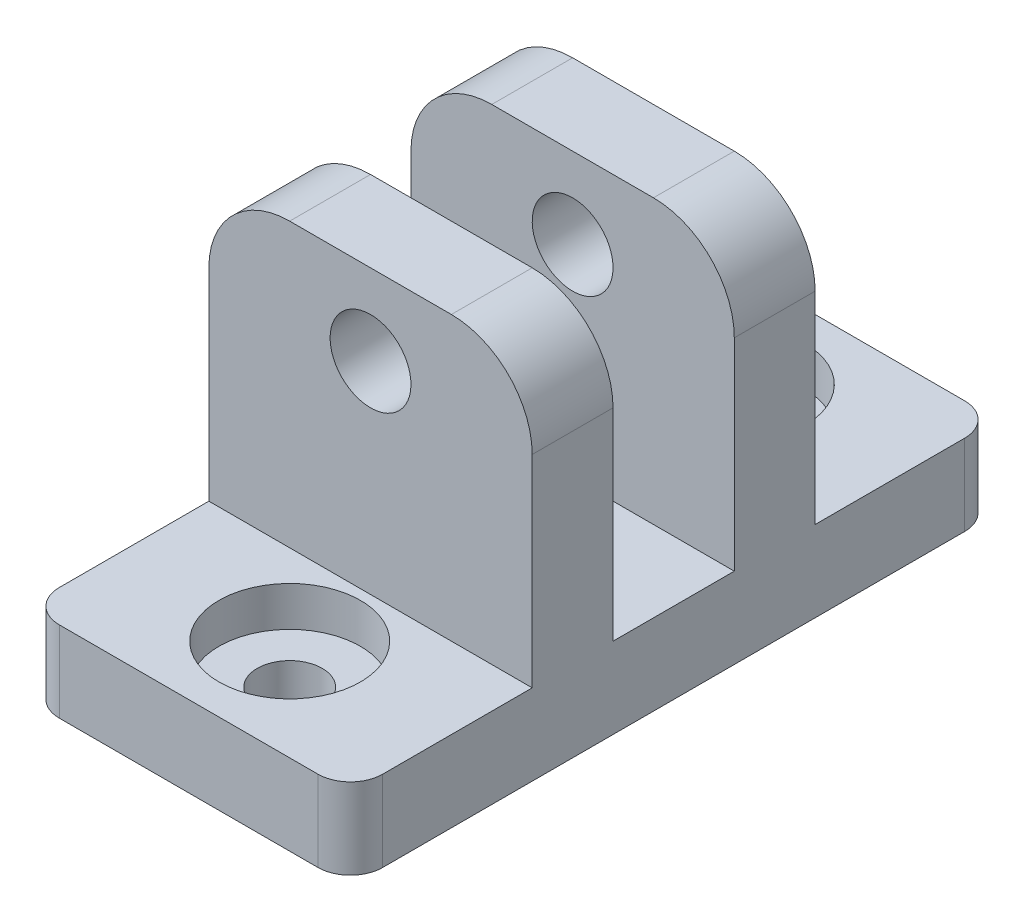
ISO-10303-21;
HEADER;
FILE_DESCRIPTION(('STEP AP214'),'2;1');
FILE_NAME('part.step','',(''),(''),'','','');
FILE_SCHEMA(('AUTOMOTIVE_DESIGN { 1 0 10303 214 1 1 1 1 }'));
ENDSEC;
DATA;
#1=APPLICATION_CONTEXT('core data for automotive mechanical design processes');
#2=APPLICATION_PROTOCOL_DEFINITION('international standard','automotive_design',2000,#1);
#3=PRODUCT_CONTEXT('',#1,'mechanical');
#4=PRODUCT('Part','Part','',(#3));
#5=PRODUCT_RELATED_PRODUCT_CATEGORY('part','',(#4));
#6=PRODUCT_DEFINITION_FORMATION('','',#4);
#7=PRODUCT_DEFINITION_CONTEXT('part definition',#1,'design');
#8=PRODUCT_DEFINITION('design','',#6,#7);
#9=PRODUCT_DEFINITION_SHAPE('','',#8);
#10=(LENGTH_UNIT() NAMED_UNIT(*) SI_UNIT(.MILLI.,.METRE.));
#11=(NAMED_UNIT(*) PLANE_ANGLE_UNIT() SI_UNIT($,.RADIAN.));
#12=(NAMED_UNIT(*) SI_UNIT($,.STERADIAN.) SOLID_ANGLE_UNIT());
#13=UNCERTAINTY_MEASURE_WITH_UNIT(LENGTH_MEASURE(1.E-05),#10,'distance_accuracy_value','');
#14=(GEOMETRIC_REPRESENTATION_CONTEXT(3) GLOBAL_UNCERTAINTY_ASSIGNED_CONTEXT((#13)) GLOBAL_UNIT_ASSIGNED_CONTEXT((#10,
#11,#12)) REPRESENTATION_CONTEXT('',''));
#15=CARTESIAN_POINT('',(0.,0.,0.));
#16=DIRECTION('',(0.,0.,1.));
#17=DIRECTION('',(1.,0.,0.));
#18=AXIS2_PLACEMENT_3D('',#15,#16,#17);
#19=CARTESIAN_POINT('',(0.,28.575,0.));
#20=DIRECTION('',(0.,-1.,0.));
#21=DIRECTION('',(0.,0.,-1.));
#22=AXIS2_PLACEMENT_3D('',#19,#20,#21);
#23=PLANE('',#22);
#24=DIRECTION('',(1.,0.,0.));
#25=VECTOR('',#24,1.);
#26=CARTESIAN_POINT('',(-12.7,28.575,11.1125));
#27=LINE('',#26,#25);
#28=CARTESIAN_POINT('',(-6.35,28.575,11.1125));
#29=VERTEX_POINT('',#28);
#30=CARTESIAN_POINT('',(6.35,28.575,11.1125));
#31=VERTEX_POINT('',#30);
#32=EDGE_CURVE('E314',#29,#31,#27,.T.);
#33=ORIENTED_EDGE('',*,*,#32,.T.);
#34=DIRECTION('',(0.,0.,-1.));
#35=VECTOR('',#34,1.);
#36=CARTESIAN_POINT('',(6.35,28.575,0.));
#37=LINE('',#36,#35);
#38=CARTESIAN_POINT('',(6.35,28.575,4.7625));
#39=VERTEX_POINT('',#38);
#40=EDGE_CURVE('E344',#31,#39,#37,.T.);
#41=ORIENTED_EDGE('',*,*,#40,.T.);
#42=DIRECTION('',(1.,0.,0.));
#43=VECTOR('',#42,1.);
#44=CARTESIAN_POINT('',(-12.7,28.575,4.7625));
#45=LINE('',#44,#43);
#46=CARTESIAN_POINT('',(-6.35,28.575,4.7625));
#47=VERTEX_POINT('',#46);
#48=EDGE_CURVE('E258',#47,#39,#45,.T.);
#49=ORIENTED_EDGE('',*,*,#48,.F.);
#50=DIRECTION('',(0.,0.,1.));
#51=VECTOR('',#50,1.);
#52=CARTESIAN_POINT('',(-6.35,28.575,0.));
#53=LINE('',#52,#51);
#54=EDGE_CURVE('E340',#47,#29,#53,.T.);
#55=ORIENTED_EDGE('',*,*,#54,.T.);
#56=EDGE_LOOP('',(#33,#41,#49,#55));
#57=FACE_BOUND('',#56,.T.);
#58=ADVANCED_FACE('F44',(#57),#23,.F.);
#59=CARTESIAN_POINT('',(12.7,28.575,25.4));
#60=DIRECTION('',(-1.,0.,0.));
#61=DIRECTION('',(0.,0.,1.));
#62=AXIS2_PLACEMENT_3D('',#59,#60,#61);
#63=PLANE('',#62);
#64=DIRECTION('',(0.,0.,-1.));
#65=VECTOR('',#64,1.);
#66=CARTESIAN_POINT('',(12.7,6.35,25.4));
#67=LINE('',#66,#65);
#68=CARTESIAN_POINT('',(12.7,6.35,22.86));
#69=VERTEX_POINT('',#68);
#70=CARTESIAN_POINT('',(12.7,6.35,11.1125));
#71=VERTEX_POINT('',#70);
#72=EDGE_CURVE('E262',#69,#71,#67,.T.);
#73=ORIENTED_EDGE('',*,*,#72,.F.);
#74=DIRECTION('',(0.,-1.,0.));
#75=VECTOR('',#74,1.);
#76=CARTESIAN_POINT('',(12.7,28.575,22.86));
#77=LINE('',#76,#75);
#78=CARTESIAN_POINT('',(12.7,0.,22.86));
#79=VERTEX_POINT('',#78);
#80=EDGE_CURVE('E394',#69,#79,#77,.T.);
#81=ORIENTED_EDGE('',*,*,#80,.T.);
#82=DIRECTION('',(0.,0.,-1.));
#83=VECTOR('',#82,1.);
#84=CARTESIAN_POINT('',(12.7,0.,25.4));
#85=LINE('',#84,#83);
#86=CARTESIAN_POINT('',(12.7,0.,-22.86));
#87=VERTEX_POINT('',#86);
#88=EDGE_CURVE('E318',#79,#87,#85,.T.);
#89=ORIENTED_EDGE('',*,*,#88,.T.);
#90=DIRECTION('',(0.,-1.,0.));
#91=VECTOR('',#90,1.);
#92=CARTESIAN_POINT('',(12.7,28.575,-22.86));
#93=LINE('',#92,#91);
#94=CARTESIAN_POINT('',(12.7,6.35,-22.86));
#95=VERTEX_POINT('',#94);
#96=EDGE_CURVE('E391',#87,#95,#93,.F.);
#97=ORIENTED_EDGE('',*,*,#96,.T.);
#98=DIRECTION('',(0.,0.,-1.));
#99=VECTOR('',#98,1.);
#100=CARTESIAN_POINT('',(12.7,6.35,-25.4));
#101=LINE('',#100,#99);
#102=CARTESIAN_POINT('',(12.7,6.35,-11.1125));
#103=VERTEX_POINT('',#102);
#104=EDGE_CURVE('E235',#103,#95,#101,.T.);
#105=ORIENTED_EDGE('',*,*,#104,.F.);
#106=DIRECTION('',(0.,-1.,0.));
#107=VECTOR('',#106,1.);
#108=CARTESIAN_POINT('',(12.7,28.575,-11.1125));
#109=LINE('',#108,#107);
#110=CARTESIAN_POINT('',(12.7,22.225,-11.1125));
#111=VERTEX_POINT('',#110);
#112=EDGE_CURVE('E242',#111,#103,#109,.T.);
#113=ORIENTED_EDGE('',*,*,#112,.F.);
#114=DIRECTION('',(0.,0.,-1.));
#115=VECTOR('',#114,1.);
#116=CARTESIAN_POINT('',(12.7,22.225,25.4));
#117=LINE('',#116,#115);
#118=CARTESIAN_POINT('',(12.7,22.225,-4.7625));
#119=VERTEX_POINT('',#118);
#120=EDGE_CURVE('E354',#111,#119,#117,.F.);
#121=ORIENTED_EDGE('',*,*,#120,.T.);
#122=DIRECTION('',(0.,1.,0.));
#123=VECTOR('',#122,1.);
#124=CARTESIAN_POINT('',(12.7,28.575,-4.7625));
#125=LINE('',#124,#123);
#126=CARTESIAN_POINT('',(12.7,6.35,-4.7625));
#127=VERTEX_POINT('',#126);
#128=EDGE_CURVE('E268',#127,#119,#125,.T.);
#129=ORIENTED_EDGE('',*,*,#128,.F.);
#130=DIRECTION('',(0.,0.,-1.));
#131=VECTOR('',#130,1.);
#132=CARTESIAN_POINT('',(12.7,6.35,4.76249999999999));
#133=LINE('',#132,#131);
#134=CARTESIAN_POINT('',(12.7,6.35,4.76249999999999));
#135=VERTEX_POINT('',#134);
#136=EDGE_CURVE('E279',#135,#127,#133,.T.);
#137=ORIENTED_EDGE('',*,*,#136,.F.);
#138=DIRECTION('',(0.,-1.,0.));
#139=VECTOR('',#138,1.);
#140=CARTESIAN_POINT('',(12.7,28.575,4.7625));
#141=LINE('',#140,#139);
#142=CARTESIAN_POINT('',(12.7,22.225,4.7625));
#143=VERTEX_POINT('',#142);
#144=EDGE_CURVE('E276',#143,#135,#141,.T.);
#145=ORIENTED_EDGE('',*,*,#144,.F.);
#146=DIRECTION('',(0.,0.,-1.));
#147=VECTOR('',#146,1.);
#148=CARTESIAN_POINT('',(12.7,22.225,25.4));
#149=LINE('',#148,#147);
#150=CARTESIAN_POINT('',(12.7,22.225,11.1125));
#151=VERTEX_POINT('',#150);
#152=EDGE_CURVE('E357',#143,#151,#149,.F.);
#153=ORIENTED_EDGE('',*,*,#152,.T.);
#154=DIRECTION('',(0.,1.,0.));
#155=VECTOR('',#154,1.);
#156=CARTESIAN_POINT('',(12.7,28.575,11.1125));
#157=LINE('',#156,#155);
#158=EDGE_CURVE('E304',#71,#151,#157,.T.);
#159=ORIENTED_EDGE('',*,*,#158,.F.);
#160=EDGE_LOOP('',(#73,#81,#89,#97,#105,#113,#121,#129,#137,#145,#153,#159));
#161=FACE_BOUND('',#160,.T.);
#162=ADVANCED_FACE('F458',(#161),#63,.F.);
#163=CARTESIAN_POINT('',(-12.7,28.575,-25.4));
#164=DIRECTION('',(0.,0.,1.));
#165=DIRECTION('',(1.,0.,0.));
#166=AXIS2_PLACEMENT_3D('',#163,#164,#165);
#167=PLANE('',#166);
#168=DIRECTION('',(1.,0.,0.));
#169=VECTOR('',#168,1.);
#170=CARTESIAN_POINT('',(-12.7,6.35,-25.4));
#171=LINE('',#170,#169);
#172=CARTESIAN_POINT('',(-10.16,6.35,-25.4));
#173=VERTEX_POINT('',#172);
#174=CARTESIAN_POINT('',(10.16,6.35,-25.4));
#175=VERTEX_POINT('',#174);
#176=EDGE_CURVE('E245',#173,#175,#171,.T.);
#177=ORIENTED_EDGE('',*,*,#176,.T.);
#178=DIRECTION('',(0.,-1.,0.));
#179=VECTOR('',#178,1.);
#180=CARTESIAN_POINT('',(10.16,28.575,-25.4));
#181=LINE('',#180,#179);
#182=CARTESIAN_POINT('',(10.16,0.,-25.4));
#183=VERTEX_POINT('',#182);
#184=EDGE_CURVE('E426',#175,#183,#181,.T.);
#185=ORIENTED_EDGE('',*,*,#184,.T.);
#186=DIRECTION('',(-1.,0.,0.));
#187=VECTOR('',#186,1.);
#188=CARTESIAN_POINT('',(-12.7,0.,-25.4));
#189=LINE('',#188,#187);
#190=CARTESIAN_POINT('',(-10.16,0.,-25.4));
#191=VERTEX_POINT('',#190);
#192=EDGE_CURVE('E329',#183,#191,#189,.T.);
#193=ORIENTED_EDGE('',*,*,#192,.T.);
#194=DIRECTION('',(0.,-1.,0.));
#195=VECTOR('',#194,1.);
#196=CARTESIAN_POINT('',(-10.16,28.575,-25.4));
#197=LINE('',#196,#195);
#198=EDGE_CURVE('E423',#191,#173,#197,.F.);
#199=ORIENTED_EDGE('',*,*,#198,.T.);
#200=EDGE_LOOP('',(#177,#185,#193,#199));
#201=FACE_BOUND('',#200,.T.);
#202=ADVANCED_FACE('F465',(#201),#167,.F.);
#203=CARTESIAN_POINT('',(-12.7,28.575,25.4));
#204=DIRECTION('',(1.,0.,0.));
#205=DIRECTION('',(0.,0.,-1.));
#206=AXIS2_PLACEMENT_3D('',#203,#204,#205);
#207=PLANE('',#206);
#208=DIRECTION('',(0.,0.,1.));
#209=VECTOR('',#208,1.);
#210=CARTESIAN_POINT('',(-12.7,0.,25.4));
#211=LINE('',#210,#209);
#212=CARTESIAN_POINT('',(-12.7,0.,-22.86));
#213=VERTEX_POINT('',#212);
#214=CARTESIAN_POINT('',(-12.7,0.,22.86));
#215=VERTEX_POINT('',#214);
#216=EDGE_CURVE('E333',#213,#215,#211,.T.);
#217=ORIENTED_EDGE('',*,*,#216,.T.);
#218=DIRECTION('',(0.,-1.,0.));
#219=VECTOR('',#218,1.);
#220=CARTESIAN_POINT('',(-12.7,28.575,22.86));
#221=LINE('',#220,#219);
#222=CARTESIAN_POINT('',(-12.7,6.35,22.86));
#223=VERTEX_POINT('',#222);
#224=EDGE_CURVE('E11',#215,#223,#221,.F.);
#225=ORIENTED_EDGE('',*,*,#224,.T.);
#226=DIRECTION('',(0.,0.,-1.));
#227=VECTOR('',#226,1.);
#228=CARTESIAN_POINT('',(-12.7,6.35,25.4));
#229=LINE('',#228,#227);
#230=CARTESIAN_POINT('',(-12.7,6.35,11.1125));
#231=VERTEX_POINT('',#230);
#232=EDGE_CURVE('E300',#223,#231,#229,.T.);
#233=ORIENTED_EDGE('',*,*,#232,.T.);
#234=DIRECTION('',(0.,1.,0.));
#235=VECTOR('',#234,1.);
#236=CARTESIAN_POINT('',(-12.7,28.575,11.1125));
#237=LINE('',#236,#235);
#238=CARTESIAN_POINT('',(-12.7,22.225,11.1125));
#239=VERTEX_POINT('',#238);
#240=EDGE_CURVE('E303',#231,#239,#237,.T.);
#241=ORIENTED_EDGE('',*,*,#240,.T.);
#242=DIRECTION('',(0.,0.,1.));
#243=VECTOR('',#242,1.);
#244=CARTESIAN_POINT('',(-12.7,22.225,25.4));
#245=LINE('',#244,#243);
#246=CARTESIAN_POINT('',(-12.7,22.225,4.7625));
#247=VERTEX_POINT('',#246);
#248=EDGE_CURVE('E386',#239,#247,#245,.F.);
#249=ORIENTED_EDGE('',*,*,#248,.T.);
#250=DIRECTION('',(0.,-1.,0.));
#251=VECTOR('',#250,1.);
#252=CARTESIAN_POINT('',(-12.7,28.575,4.7625));
#253=LINE('',#252,#251);
#254=CARTESIAN_POINT('',(-12.7,6.35,4.76249999999999));
#255=VERTEX_POINT('',#254);
#256=EDGE_CURVE('E264',#247,#255,#253,.T.);
#257=ORIENTED_EDGE('',*,*,#256,.T.);
#258=DIRECTION('',(0.,0.,-1.));
#259=VECTOR('',#258,1.);
#260=CARTESIAN_POINT('',(-12.7,6.35,4.76249999999999));
#261=LINE('',#260,#259);
#262=CARTESIAN_POINT('',(-12.7,6.35,-4.7625));
#263=VERTEX_POINT('',#262);
#264=EDGE_CURVE('E267',#255,#263,#261,.T.);
#265=ORIENTED_EDGE('',*,*,#264,.T.);
#266=DIRECTION('',(0.,1.,0.));
#267=VECTOR('',#266,1.);
#268=CARTESIAN_POINT('',(-12.7,28.575,-4.7625));
#269=LINE('',#268,#267);
#270=CARTESIAN_POINT('',(-12.7,22.225,-4.7625));
#271=VERTEX_POINT('',#270);
#272=EDGE_CURVE('E272',#263,#271,#269,.T.);
#273=ORIENTED_EDGE('',*,*,#272,.T.);
#274=DIRECTION('',(0.,0.,1.));
#275=VECTOR('',#274,1.);
#276=CARTESIAN_POINT('',(-12.7,22.225,25.4));
#277=LINE('',#276,#275);
#278=CARTESIAN_POINT('',(-12.7,22.225,-11.1125));
#279=VERTEX_POINT('',#278);
#280=EDGE_CURVE('E231',#271,#279,#277,.F.);
#281=ORIENTED_EDGE('',*,*,#280,.T.);
#282=DIRECTION('',(0.,-1.,0.));
#283=VECTOR('',#282,1.);
#284=CARTESIAN_POINT('',(-12.7,28.575,-11.1125));
#285=LINE('',#284,#283);
#286=CARTESIAN_POINT('',(-12.7,6.35,-11.1125));
#287=VERTEX_POINT('',#286);
#288=EDGE_CURVE('E222',#279,#287,#285,.T.);
#289=ORIENTED_EDGE('',*,*,#288,.T.);
#290=DIRECTION('',(0.,0.,-1.));
#291=VECTOR('',#290,1.);
#292=CARTESIAN_POINT('',(-12.7,6.35,-25.4));
#293=LINE('',#292,#291);
#294=CARTESIAN_POINT('',(-12.7,6.35,-22.86));
#295=VERTEX_POINT('',#294);
#296=EDGE_CURVE('E227',#287,#295,#293,.T.);
#297=ORIENTED_EDGE('',*,*,#296,.T.);
#298=DIRECTION('',(0.,-1.,0.));
#299=VECTOR('',#298,1.);
#300=CARTESIAN_POINT('',(-12.7,28.575,-22.86));
#301=LINE('',#300,#299);
#302=EDGE_CURVE('E53',#295,#213,#301,.T.);
#303=ORIENTED_EDGE('',*,*,#302,.T.);
#304=EDGE_LOOP('',(#217,#225,#233,#241,#249,#257,#265,#273,#281,#289,#297,#303));
#305=FACE_BOUND('',#304,.T.);
#306=ADVANCED_FACE('F225',(#305),#207,.F.);
#307=CARTESIAN_POINT('',(-12.7,28.575,25.4));
#308=DIRECTION('',(0.,0.,-1.));
#309=DIRECTION('',(-1.,0.,0.));
#310=AXIS2_PLACEMENT_3D('',#307,#308,#309);
#311=PLANE('',#310);
#312=DIRECTION('',(1.,0.,0.));
#313=VECTOR('',#312,1.);
#314=CARTESIAN_POINT('',(-12.7,0.,25.4));
#315=LINE('',#314,#313);
#316=CARTESIAN_POINT('',(-10.16,0.,25.4));
#317=VERTEX_POINT('',#316);
#318=CARTESIAN_POINT('',(10.16,0.,25.4));
#319=VERTEX_POINT('',#318);
#320=EDGE_CURVE('E336',#317,#319,#315,.T.);
#321=ORIENTED_EDGE('',*,*,#320,.T.);
#322=DIRECTION('',(0.,-1.,0.));
#323=VECTOR('',#322,1.);
#324=CARTESIAN_POINT('',(10.16,28.575,25.4));
#325=LINE('',#324,#323);
#326=CARTESIAN_POINT('',(10.16,6.35,25.4));
#327=VERTEX_POINT('',#326);
#328=EDGE_CURVE('E414',#319,#327,#325,.F.);
#329=ORIENTED_EDGE('',*,*,#328,.T.);
#330=DIRECTION('',(1.,0.,0.));
#331=VECTOR('',#330,1.);
#332=CARTESIAN_POINT('',(-12.7,6.35,25.4));
#333=LINE('',#332,#331);
#334=CARTESIAN_POINT('',(-10.16,6.35,25.4));
#335=VERTEX_POINT('',#334);
#336=EDGE_CURVE('E308',#335,#327,#333,.T.);
#337=ORIENTED_EDGE('',*,*,#336,.F.);
#338=DIRECTION('',(0.,-1.,0.));
#339=VECTOR('',#338,1.);
#340=CARTESIAN_POINT('',(-10.16,28.575,25.4));
#341=LINE('',#340,#339);
#342=EDGE_CURVE('E410',#335,#317,#341,.T.);
#343=ORIENTED_EDGE('',*,*,#342,.T.);
#344=EDGE_LOOP('',(#321,#329,#337,#343));
#345=FACE_BOUND('',#344,.T.);
#346=ADVANCED_FACE('F447',(#345),#311,.F.);
#347=DIRECTION('',(1.,0.,0.));
#348=VECTOR('',#347,1.);
#349=CARTESIAN_POINT('',(-12.7,28.575,-4.7625));
#350=LINE('',#349,#348);
#351=CARTESIAN_POINT('',(-6.35,28.575,-4.7625));
#352=VERTEX_POINT('',#351);
#353=CARTESIAN_POINT('',(6.35,28.575,-4.7625));
#354=VERTEX_POINT('',#353);
#355=EDGE_CURVE('E290',#352,#354,#350,.T.);
#356=ORIENTED_EDGE('',*,*,#355,.T.);
#357=DIRECTION('',(0.,0.,-1.));
#358=VECTOR('',#357,1.);
#359=CARTESIAN_POINT('',(6.35,28.575,0.));
#360=LINE('',#359,#358);
#361=CARTESIAN_POINT('',(6.35,28.575,-11.1125));
#362=VERTEX_POINT('',#361);
#363=EDGE_CURVE('E370',#354,#362,#360,.T.);
#364=ORIENTED_EDGE('',*,*,#363,.T.);
#365=DIRECTION('',(1.,0.,0.));
#366=VECTOR('',#365,1.);
#367=CARTESIAN_POINT('',(-12.7,28.575,-11.1125));
#368=LINE('',#367,#366);
#369=CARTESIAN_POINT('',(-6.35,28.575,-11.1125));
#370=VERTEX_POINT('',#369);
#371=EDGE_CURVE('E246',#370,#362,#368,.T.);
#372=ORIENTED_EDGE('',*,*,#371,.F.);
#373=DIRECTION('',(0.,0.,1.));
#374=VECTOR('',#373,1.);
#375=CARTESIAN_POINT('',(-6.35,28.575,0.));
#376=LINE('',#375,#374);
#377=EDGE_CURVE('E366',#370,#352,#376,.T.);
#378=ORIENTED_EDGE('',*,*,#377,.T.);
#379=EDGE_LOOP('',(#356,#364,#372,#378));
#380=FACE_BOUND('',#379,.T.);
#381=ADVANCED_FACE('F474',(#380),#23,.F.);
#382=CARTESIAN_POINT('',(0.,0.,0.));
#383=DIRECTION('',(0.,-1.,0.));
#384=DIRECTION('',(0.,0.,-1.));
#385=AXIS2_PLACEMENT_3D('',#382,#383,#384);
#386=PLANE('',#385);
#387=CARTESIAN_POINT('',(0.,0.,17.4625));
#388=DIRECTION('',(0.,1.,0.));
#389=DIRECTION('',(0.,0.,1.));
#390=AXIS2_PLACEMENT_3D('',#387,#388,#389);
#391=CIRCLE('',#390,2.5527);
#392=CARTESIAN_POINT('',(0.,0.,20.0152));
#393=VERTEX_POINT('',#392);
#394=EDGE_CURVE('E802',#393,#393,#391,.T.);
#395=ORIENTED_EDGE('',*,*,#394,.T.);
#396=EDGE_LOOP('',(#395));
#397=FACE_BOUND('',#396,.T.);
#398=CARTESIAN_POINT('',(0.,0.,-17.4625));
#399=DIRECTION('',(0.,1.,0.));
#400=DIRECTION('',(0.,0.,1.));
#401=AXIS2_PLACEMENT_3D('',#398,#399,#400);
#402=CIRCLE('',#401,2.5527);
#403=CARTESIAN_POINT('',(0.,0.,-14.9098));
#404=VERTEX_POINT('',#403);
#405=EDGE_CURVE('E280',#404,#404,#402,.T.);
#406=ORIENTED_EDGE('',*,*,#405,.T.);
#407=EDGE_LOOP('',(#406));
#408=FACE_BOUND('',#407,.T.);
#409=ORIENTED_EDGE('',*,*,#88,.F.);
#410=CARTESIAN_POINT('',(10.16,0.,22.86));
#411=DIRECTION('',(0.,-1.,0.));
#412=DIRECTION('',(0.,0.,-1.));
#413=AXIS2_PLACEMENT_3D('',#410,#411,#412);
#414=CIRCLE('',#413,2.54);
#415=EDGE_CURVE('E407',#79,#319,#414,.T.);
#416=ORIENTED_EDGE('',*,*,#415,.T.);
#417=ORIENTED_EDGE('',*,*,#320,.F.);
#418=CARTESIAN_POINT('',(-10.16,0.,22.86));
#419=DIRECTION('',(0.,-1.,0.));
#420=DIRECTION('',(0.,0.,-1.));
#421=AXIS2_PLACEMENT_3D('',#418,#419,#420);
#422=CIRCLE('',#421,2.54);
#423=EDGE_CURVE('E401',#317,#215,#422,.T.);
#424=ORIENTED_EDGE('',*,*,#423,.T.);
#425=ORIENTED_EDGE('',*,*,#216,.F.);
#426=CARTESIAN_POINT('',(-10.16,0.,-22.86));
#427=DIRECTION('',(0.,-1.,0.));
#428=DIRECTION('',(0.,0.,-1.));
#429=AXIS2_PLACEMENT_3D('',#426,#427,#428);
#430=CIRCLE('',#429,2.54);
#431=EDGE_CURVE('E398',#213,#191,#430,.T.);
#432=ORIENTED_EDGE('',*,*,#431,.T.);
#433=ORIENTED_EDGE('',*,*,#192,.F.);
#434=CARTESIAN_POINT('',(10.16,0.,-22.86));
#435=DIRECTION('',(0.,-1.,0.));
#436=DIRECTION('',(0.,0.,-1.));
#437=AXIS2_PLACEMENT_3D('',#434,#435,#436);
#438=CIRCLE('',#437,2.54);
#439=EDGE_CURVE('E404',#183,#87,#438,.T.);
#440=ORIENTED_EDGE('',*,*,#439,.T.);
#441=EDGE_LOOP('',(#409,#416,#417,#424,#425,#432,#433,#440));
#442=FACE_BOUND('',#441,.T.);
#443=ADVANCED_FACE('F438',(#397,#408,#442),#386,.T.);
#444=CARTESIAN_POINT('',(-12.7,28.575,11.1125));
#445=DIRECTION('',(0.,0.,-1.));
#446=DIRECTION('',(0.,1.,0.));
#447=AXIS2_PLACEMENT_3D('',#444,#445,#446);
#448=PLANE('',#447);
#449=CARTESIAN_POINT('',(0.,22.225,11.1125));
#450=DIRECTION('',(0.,0.,-1.));
#451=DIRECTION('',(0.,1.,0.));
#452=AXIS2_PLACEMENT_3D('',#449,#450,#451);
#453=CIRCLE('',#452,3.175);
#454=CARTESIAN_POINT('',(0.,25.4,11.1125));
#455=VERTEX_POINT('',#454);
#456=EDGE_CURVE('E779',#455,#455,#453,.T.);
#457=ORIENTED_EDGE('',*,*,#456,.T.);
#458=EDGE_LOOP('',(#457));
#459=FACE_BOUND('',#458,.T.);
#460=ORIENTED_EDGE('',*,*,#158,.T.);
#461=CARTESIAN_POINT('',(6.35,22.225,11.1125));
#462=DIRECTION('',(0.,0.,-1.));
#463=DIRECTION('',(0.,1.,0.));
#464=AXIS2_PLACEMENT_3D('',#461,#462,#463);
#465=CIRCLE('',#464,6.35);
#466=EDGE_CURVE('E363',#151,#31,#465,.F.);
#467=ORIENTED_EDGE('',*,*,#466,.T.);
#468=ORIENTED_EDGE('',*,*,#32,.F.);
#469=CARTESIAN_POINT('',(-6.35,22.225,11.1125));
#470=DIRECTION('',(0.,0.,-1.));
#471=DIRECTION('',(0.,1.,0.));
#472=AXIS2_PLACEMENT_3D('',#469,#470,#471);
#473=CIRCLE('',#472,6.35);
#474=EDGE_CURVE('E360',#29,#239,#473,.F.);
#475=ORIENTED_EDGE('',*,*,#474,.T.);
#476=ORIENTED_EDGE('',*,*,#240,.F.);
#477=DIRECTION('',(1.,0.,0.));
#478=VECTOR('',#477,1.);
#479=CARTESIAN_POINT('',(-12.7,6.35,11.1125));
#480=LINE('',#479,#478);
#481=EDGE_CURVE('E319',#231,#71,#480,.T.);
#482=ORIENTED_EDGE('',*,*,#481,.T.);
#483=EDGE_LOOP('',(#460,#467,#468,#475,#476,#482));
#484=FACE_BOUND('',#483,.T.);
#485=ADVANCED_FACE('F487',(#459,#484),#448,.F.);
#486=CARTESIAN_POINT('',(-12.7,6.35,25.4));
#487=DIRECTION('',(0.,-1.,0.));
#488=DIRECTION('',(0.,0.,-1.));
#489=AXIS2_PLACEMENT_3D('',#486,#487,#488);
#490=PLANE('',#489);
#491=CARTESIAN_POINT('',(0.,6.34999999999999,17.4625));
#492=DIRECTION('',(0.,1.,0.));
#493=DIRECTION('',(0.,0.,1.));
#494=AXIS2_PLACEMENT_3D('',#491,#492,#493);
#495=CIRCLE('',#494,5.55625);
#496=CARTESIAN_POINT('',(0.,6.34999999999999,23.01875));
#497=VERTEX_POINT('',#496);
#498=EDGE_CURVE('E782',#497,#497,#495,.T.);
#499=ORIENTED_EDGE('',*,*,#498,.F.);
#500=EDGE_LOOP('',(#499));
#501=FACE_BOUND('',#500,.T.);
#502=ORIENTED_EDGE('',*,*,#336,.T.);
#503=CARTESIAN_POINT('',(10.16,6.35,22.86));
#504=DIRECTION('',(0.,-1.,0.));
#505=DIRECTION('',(0.,0.,-1.));
#506=AXIS2_PLACEMENT_3D('',#503,#504,#505);
#507=CIRCLE('',#506,2.54);
#508=EDGE_CURVE('E420',#327,#69,#507,.F.);
#509=ORIENTED_EDGE('',*,*,#508,.T.);
#510=ORIENTED_EDGE('',*,*,#72,.T.);
#511=ORIENTED_EDGE('',*,*,#481,.F.);
#512=ORIENTED_EDGE('',*,*,#232,.F.);
#513=CARTESIAN_POINT('',(-10.16,6.35,22.86));
#514=DIRECTION('',(0.,-1.,0.));
#515=DIRECTION('',(0.,0.,-1.));
#516=AXIS2_PLACEMENT_3D('',#513,#514,#515);
#517=CIRCLE('',#516,2.54);
#518=EDGE_CURVE('E417',#223,#335,#517,.F.);
#519=ORIENTED_EDGE('',*,*,#518,.T.);
#520=EDGE_LOOP('',(#502,#509,#510,#511,#512,#519));
#521=FACE_BOUND('',#520,.T.);
#522=ADVANCED_FACE('F451',(#501,#521),#490,.F.);
#523=CARTESIAN_POINT('',(-12.7,28.575,4.7625));
#524=DIRECTION('',(0.,0.,1.));
#525=DIRECTION('',(0.,-1.,0.));
#526=AXIS2_PLACEMENT_3D('',#523,#524,#525);
#527=PLANE('',#526);
#528=CARTESIAN_POINT('',(0.,22.225,4.7625));
#529=DIRECTION('',(0.,0.,1.));
#530=DIRECTION('',(0.,-1.,0.));
#531=AXIS2_PLACEMENT_3D('',#528,#529,#530);
#532=CIRCLE('',#531,3.175);
#533=CARTESIAN_POINT('',(0.,19.05,4.7625));
#534=VERTEX_POINT('',#533);
#535=EDGE_CURVE('E783',#534,#534,#532,.T.);
#536=ORIENTED_EDGE('',*,*,#535,.T.);
#537=EDGE_LOOP('',(#536));
#538=FACE_BOUND('',#537,.T.);
#539=ORIENTED_EDGE('',*,*,#48,.T.);
#540=CARTESIAN_POINT('',(6.35,22.225,4.7625));
#541=DIRECTION('',(0.,0.,1.));
#542=DIRECTION('',(0.,-1.,0.));
#543=AXIS2_PLACEMENT_3D('',#540,#541,#542);
#544=CIRCLE('',#543,6.35);
#545=EDGE_CURVE('E351',#39,#143,#544,.F.);
#546=ORIENTED_EDGE('',*,*,#545,.T.);
#547=ORIENTED_EDGE('',*,*,#144,.T.);
#548=DIRECTION('',(1.,0.,0.));
#549=VECTOR('',#548,1.);
#550=CARTESIAN_POINT('',(-12.7,6.35,4.76249999999999));
#551=LINE('',#550,#549);
#552=EDGE_CURVE('E275',#255,#135,#551,.T.);
#553=ORIENTED_EDGE('',*,*,#552,.F.);
#554=ORIENTED_EDGE('',*,*,#256,.F.);
#555=CARTESIAN_POINT('',(-6.35,22.225,4.7625));
#556=DIRECTION('',(0.,0.,1.));
#557=DIRECTION('',(0.,-1.,0.));
#558=AXIS2_PLACEMENT_3D('',#555,#556,#557);
#559=CIRCLE('',#558,6.35);
#560=EDGE_CURVE('E348',#247,#47,#559,.F.);
#561=ORIENTED_EDGE('',*,*,#560,.T.);
#562=EDGE_LOOP('',(#539,#546,#547,#553,#554,#561));
#563=FACE_BOUND('',#562,.T.);
#564=ADVANCED_FACE('F525',(#538,#563),#527,.F.);
#565=CARTESIAN_POINT('',(-12.7,28.575,-4.7625));
#566=DIRECTION('',(0.,0.,-1.));
#567=DIRECTION('',(0.,1.,0.));
#568=AXIS2_PLACEMENT_3D('',#565,#566,#567);
#569=PLANE('',#568);
#570=CARTESIAN_POINT('',(0.,22.225,-4.7625));
#571=DIRECTION('',(0.,0.,-1.));
#572=DIRECTION('',(0.,1.,0.));
#573=AXIS2_PLACEMENT_3D('',#570,#571,#572);
#574=CIRCLE('',#573,3.175);
#575=CARTESIAN_POINT('',(0.,25.4,-4.7625));
#576=VERTEX_POINT('',#575);
#577=EDGE_CURVE('E791',#576,#576,#574,.T.);
#578=ORIENTED_EDGE('',*,*,#577,.T.);
#579=EDGE_LOOP('',(#578));
#580=FACE_BOUND('',#579,.T.);
#581=ORIENTED_EDGE('',*,*,#128,.T.);
#582=CARTESIAN_POINT('',(6.35,22.225,-4.7625));
#583=DIRECTION('',(0.,0.,-1.));
#584=DIRECTION('',(0.,1.,0.));
#585=AXIS2_PLACEMENT_3D('',#582,#583,#584);
#586=CIRCLE('',#585,6.35);
#587=EDGE_CURVE('E383',#119,#354,#586,.F.);
#588=ORIENTED_EDGE('',*,*,#587,.T.);
#589=ORIENTED_EDGE('',*,*,#355,.F.);
#590=CARTESIAN_POINT('',(-6.35,22.225,-4.7625));
#591=DIRECTION('',(0.,0.,-1.));
#592=DIRECTION('',(0.,1.,0.));
#593=AXIS2_PLACEMENT_3D('',#590,#591,#592);
#594=CIRCLE('',#593,6.35);
#595=EDGE_CURVE('E380',#352,#271,#594,.F.);
#596=ORIENTED_EDGE('',*,*,#595,.T.);
#597=ORIENTED_EDGE('',*,*,#272,.F.);
#598=DIRECTION('',(1.,0.,0.));
#599=VECTOR('',#598,1.);
#600=CARTESIAN_POINT('',(-12.7,6.35,-4.7625));
#601=LINE('',#600,#599);
#602=EDGE_CURVE('E294',#263,#127,#601,.T.);
#603=ORIENTED_EDGE('',*,*,#602,.T.);
#604=EDGE_LOOP('',(#581,#588,#589,#596,#597,#603));
#605=FACE_BOUND('',#604,.T.);
#606=ADVANCED_FACE('F501',(#580,#605),#569,.F.);
#607=CARTESIAN_POINT('',(-12.7,6.35,4.76249999999999));
#608=DIRECTION('',(0.,-1.,0.));
#609=DIRECTION('',(0.,0.,-1.));
#610=AXIS2_PLACEMENT_3D('',#607,#608,#609);
#611=PLANE('',#610);
#612=ORIENTED_EDGE('',*,*,#136,.T.);
#613=ORIENTED_EDGE('',*,*,#602,.F.);
#614=ORIENTED_EDGE('',*,*,#264,.F.);
#615=ORIENTED_EDGE('',*,*,#552,.T.);
#616=EDGE_LOOP('',(#612,#613,#614,#615));
#617=FACE_BOUND('',#616,.T.);
#618=ADVANCED_FACE('F505',(#617),#611,.F.);
#619=CARTESIAN_POINT('',(-12.7,6.35,-25.4));
#620=DIRECTION('',(0.,-1.,0.));
#621=DIRECTION('',(0.,0.,-1.));
#622=AXIS2_PLACEMENT_3D('',#619,#620,#621);
#623=PLANE('',#622);
#624=CARTESIAN_POINT('',(0.,6.35,-17.4625));
#625=DIRECTION('',(0.,1.,0.));
#626=DIRECTION('',(0.,0.,1.));
#627=AXIS2_PLACEMENT_3D('',#624,#625,#626);
#628=CIRCLE('',#627,5.55625);
#629=CARTESIAN_POINT('',(0.,6.35,-11.90625));
#630=VERTEX_POINT('',#629);
#631=EDGE_CURVE('E806',#630,#630,#628,.T.);
#632=ORIENTED_EDGE('',*,*,#631,.F.);
#633=EDGE_LOOP('',(#632));
#634=FACE_BOUND('',#633,.T.);
#635=ORIENTED_EDGE('',*,*,#104,.T.);
#636=CARTESIAN_POINT('',(10.16,6.35,-22.86));
#637=DIRECTION('',(0.,-1.,0.));
#638=DIRECTION('',(0.,0.,-1.));
#639=AXIS2_PLACEMENT_3D('',#636,#637,#638);
#640=CIRCLE('',#639,2.54);
#641=EDGE_CURVE('E72',#95,#175,#640,.F.);
#642=ORIENTED_EDGE('',*,*,#641,.T.);
#643=ORIENTED_EDGE('',*,*,#176,.F.);
#644=CARTESIAN_POINT('',(-10.16,6.35,-22.86));
#645=DIRECTION('',(0.,-1.,0.));
#646=DIRECTION('',(0.,0.,-1.));
#647=AXIS2_PLACEMENT_3D('',#644,#645,#646);
#648=CIRCLE('',#647,2.54);
#649=EDGE_CURVE('E63',#173,#295,#648,.F.);
#650=ORIENTED_EDGE('',*,*,#649,.T.);
#651=ORIENTED_EDGE('',*,*,#296,.F.);
#652=DIRECTION('',(1.,0.,0.));
#653=VECTOR('',#652,1.);
#654=CARTESIAN_POINT('',(-12.7,6.35,-11.1125));
#655=LINE('',#654,#653);
#656=EDGE_CURVE('E238',#287,#103,#655,.T.);
#657=ORIENTED_EDGE('',*,*,#656,.T.);
#658=EDGE_LOOP('',(#635,#642,#643,#650,#651,#657));
#659=FACE_BOUND('',#658,.T.);
#660=ADVANCED_FACE('F248',(#634,#659),#623,.F.);
#661=CARTESIAN_POINT('',(-12.7,28.575,-11.1125));
#662=DIRECTION('',(0.,0.,1.));
#663=DIRECTION('',(0.,-1.,0.));
#664=AXIS2_PLACEMENT_3D('',#661,#662,#663);
#665=PLANE('',#664);
#666=CARTESIAN_POINT('',(0.,22.225,-11.1125));
#667=DIRECTION('',(0.,0.,-1.));
#668=DIRECTION('',(0.,1.,0.));
#669=AXIS2_PLACEMENT_3D('',#666,#667,#668);
#670=CIRCLE('',#669,3.175);
#671=CARTESIAN_POINT('',(0.,25.4,-11.1125));
#672=VERTEX_POINT('',#671);
#673=EDGE_CURVE('E828',#672,#672,#670,.T.);
#674=ORIENTED_EDGE('',*,*,#673,.F.);
#675=EDGE_LOOP('',(#674));
#676=FACE_BOUND('',#675,.T.);
#677=ORIENTED_EDGE('',*,*,#371,.T.);
#678=CARTESIAN_POINT('',(6.35,22.225,-11.1125));
#679=DIRECTION('',(0.,0.,1.));
#680=DIRECTION('',(0.,-1.,0.));
#681=AXIS2_PLACEMENT_3D('',#678,#679,#680);
#682=CIRCLE('',#681,6.35);
#683=EDGE_CURVE('E377',#362,#111,#682,.F.);
#684=ORIENTED_EDGE('',*,*,#683,.T.);
#685=ORIENTED_EDGE('',*,*,#112,.T.);
#686=ORIENTED_EDGE('',*,*,#656,.F.);
#687=ORIENTED_EDGE('',*,*,#288,.F.);
#688=CARTESIAN_POINT('',(-6.35,22.225,-11.1125));
#689=DIRECTION('',(0.,0.,1.));
#690=DIRECTION('',(0.,-1.,0.));
#691=AXIS2_PLACEMENT_3D('',#688,#689,#690);
#692=CIRCLE('',#691,6.35);
#693=EDGE_CURVE('E374',#279,#370,#692,.F.);
#694=ORIENTED_EDGE('',*,*,#693,.T.);
#695=EDGE_LOOP('',(#677,#684,#685,#686,#687,#694));
#696=FACE_BOUND('',#695,.T.);
#697=ADVANCED_FACE('F240',(#676,#696),#665,.F.);
#698=CARTESIAN_POINT('',(0.,6.35,-17.4625));
#699=DIRECTION('',(0.,1.,0.));
#700=DIRECTION('',(0.,0.,1.));
#701=AXIS2_PLACEMENT_3D('',#698,#699,#700);
#702=CYLINDRICAL_SURFACE('',#701,2.5527);
#703=ORIENTED_EDGE('',*,*,#405,.F.);
#704=EDGE_LOOP('',(#703));
#705=FACE_BOUND('',#704,.T.);
#706=CARTESIAN_POINT('',(0.,3.2258,-17.4625));
#707=DIRECTION('',(0.,1.,0.));
#708=DIRECTION('',(0.,0.,1.));
#709=AXIS2_PLACEMENT_3D('',#706,#707,#708);
#710=CIRCLE('',#709,2.5527);
#711=CARTESIAN_POINT('',(0.,3.2258,-14.9098));
#712=VERTEX_POINT('',#711);
#713=EDGE_CURVE('E814',#712,#712,#710,.T.);
#714=ORIENTED_EDGE('',*,*,#713,.T.);
#715=EDGE_LOOP('',(#714));
#716=FACE_BOUND('',#715,.T.);
#717=ADVANCED_FACE('F648',(#705,#716),#702,.F.);
#718=CARTESIAN_POINT('',(2.55269999999999,3.2258,-17.4625));
#719=DIRECTION('',(0.,-1.,0.));
#720=DIRECTION('',(0.,0.,-1.));
#721=AXIS2_PLACEMENT_3D('',#718,#719,#720);
#722=PLANE('',#721);
#723=ORIENTED_EDGE('',*,*,#713,.F.);
#724=EDGE_LOOP('',(#723));
#725=FACE_BOUND('',#724,.T.);
#726=CARTESIAN_POINT('',(0.,3.2258,-17.4625));
#727=DIRECTION('',(0.,1.,0.));
#728=DIRECTION('',(0.,0.,1.));
#729=AXIS2_PLACEMENT_3D('',#726,#727,#728);
#730=CIRCLE('',#729,5.55625);
#731=CARTESIAN_POINT('',(0.,3.2258,-11.90625));
#732=VERTEX_POINT('',#731);
#733=EDGE_CURVE('E810',#732,#732,#730,.T.);
#734=ORIENTED_EDGE('',*,*,#733,.T.);
#735=EDGE_LOOP('',(#734));
#736=FACE_BOUND('',#735,.T.);
#737=ADVANCED_FACE('F639',(#725,#736),#722,.F.);
#738=CARTESIAN_POINT('',(0.,6.35,-17.4625));
#739=DIRECTION('',(0.,1.,0.));
#740=DIRECTION('',(0.,0.,1.));
#741=AXIS2_PLACEMENT_3D('',#738,#739,#740);
#742=CYLINDRICAL_SURFACE('',#741,5.55625);
#743=ORIENTED_EDGE('',*,*,#733,.F.);
#744=EDGE_LOOP('',(#743));
#745=FACE_BOUND('',#744,.T.);
#746=ORIENTED_EDGE('',*,*,#631,.T.);
#747=EDGE_LOOP('',(#746));
#748=FACE_BOUND('',#747,.T.);
#749=ADVANCED_FACE('F630',(#745,#748),#742,.F.);
#750=CARTESIAN_POINT('',(0.,6.34999999999999,17.4625));
#751=DIRECTION('',(0.,1.,0.));
#752=DIRECTION('',(0.,0.,1.));
#753=AXIS2_PLACEMENT_3D('',#750,#751,#752);
#754=CYLINDRICAL_SURFACE('',#753,2.5527);
#755=ORIENTED_EDGE('',*,*,#394,.F.);
#756=EDGE_LOOP('',(#755));
#757=FACE_BOUND('',#756,.T.);
#758=CARTESIAN_POINT('',(0.,3.22579999999999,17.4625));
#759=DIRECTION('',(0.,1.,0.));
#760=DIRECTION('',(0.,0.,1.));
#761=AXIS2_PLACEMENT_3D('',#758,#759,#760);
#762=CIRCLE('',#761,2.5527);
#763=CARTESIAN_POINT('',(0.,3.22579999999999,20.0152));
#764=VERTEX_POINT('',#763);
#765=EDGE_CURVE('E798',#764,#764,#762,.T.);
#766=ORIENTED_EDGE('',*,*,#765,.T.);
#767=EDGE_LOOP('',(#766));
#768=FACE_BOUND('',#767,.T.);
#769=ADVANCED_FACE('F621',(#757,#768),#754,.F.);
#770=CARTESIAN_POINT('',(2.5527,3.22579999999999,17.4625));
#771=DIRECTION('',(0.,-1.,0.));
#772=DIRECTION('',(0.,0.,-1.));
#773=AXIS2_PLACEMENT_3D('',#770,#771,#772);
#774=PLANE('',#773);
#775=ORIENTED_EDGE('',*,*,#765,.F.);
#776=EDGE_LOOP('',(#775));
#777=FACE_BOUND('',#776,.T.);
#778=CARTESIAN_POINT('',(0.,3.22579999999999,17.4625));
#779=DIRECTION('',(0.,1.,0.));
#780=DIRECTION('',(0.,0.,1.));
#781=AXIS2_PLACEMENT_3D('',#778,#779,#780);
#782=CIRCLE('',#781,5.55625);
#783=CARTESIAN_POINT('',(0.,3.22579999999999,23.01875));
#784=VERTEX_POINT('',#783);
#785=EDGE_CURVE('E787',#784,#784,#782,.T.);
#786=ORIENTED_EDGE('',*,*,#785,.T.);
#787=EDGE_LOOP('',(#786));
#788=FACE_BOUND('',#787,.T.);
#789=ADVANCED_FACE('F612',(#777,#788),#774,.F.);
#790=CARTESIAN_POINT('',(0.,6.34999999999999,17.4625));
#791=DIRECTION('',(0.,1.,0.));
#792=DIRECTION('',(0.,0.,1.));
#793=AXIS2_PLACEMENT_3D('',#790,#791,#792);
#794=CYLINDRICAL_SURFACE('',#793,5.55625);
#795=ORIENTED_EDGE('',*,*,#785,.F.);
#796=EDGE_LOOP('',(#795));
#797=FACE_BOUND('',#796,.T.);
#798=ORIENTED_EDGE('',*,*,#498,.T.);
#799=EDGE_LOOP('',(#798));
#800=FACE_BOUND('',#799,.T.);
#801=ADVANCED_FACE('F603',(#797,#800),#794,.F.);
#802=CARTESIAN_POINT('',(0.,22.225,25.4));
#803=DIRECTION('',(0.,0.,-1.));
#804=DIRECTION('',(0.,1.,0.));
#805=AXIS2_PLACEMENT_3D('',#802,#803,#804);
#806=CYLINDRICAL_SURFACE('',#805,3.175);
#807=ORIENTED_EDGE('',*,*,#673,.T.);
#808=EDGE_LOOP('',(#807));
#809=FACE_BOUND('',#808,.T.);
#810=ORIENTED_EDGE('',*,*,#577,.F.);
#811=EDGE_LOOP('',(#810));
#812=FACE_BOUND('',#811,.T.);
#813=ADVANCED_FACE('F594',(#809,#812),#806,.F.);
#814=ORIENTED_EDGE('',*,*,#535,.F.);
#815=EDGE_LOOP('',(#814));
#816=FACE_BOUND('',#815,.T.);
#817=ORIENTED_EDGE('',*,*,#456,.F.);
#818=EDGE_LOOP('',(#817));
#819=FACE_BOUND('',#818,.T.);
#820=ADVANCED_FACE('F586',(#816,#819),#806,.F.);
#821=CARTESIAN_POINT('',(6.35,22.225,0.));
#822=DIRECTION('',(0.,0.,-1.));
#823=DIRECTION('',(-1.,0.,0.));
#824=AXIS2_PLACEMENT_3D('',#821,#822,#823);
#825=CYLINDRICAL_SURFACE('',#824,6.35);
#826=ORIENTED_EDGE('',*,*,#466,.F.);
#827=ORIENTED_EDGE('',*,*,#152,.F.);
#828=ORIENTED_EDGE('',*,*,#545,.F.);
#829=ORIENTED_EDGE('',*,*,#40,.F.);
#830=EDGE_LOOP('',(#826,#827,#828,#829));
#831=FACE_BOUND('',#830,.T.);
#832=ADVANCED_FACE('F512',(#831),#825,.T.);
#833=CARTESIAN_POINT('',(6.35,22.225,0.));
#834=DIRECTION('',(0.,0.,-1.));
#835=DIRECTION('',(-1.,0.,0.));
#836=AXIS2_PLACEMENT_3D('',#833,#834,#835);
#837=CYLINDRICAL_SURFACE('',#836,6.35);
#838=ORIENTED_EDGE('',*,*,#587,.F.);
#839=ORIENTED_EDGE('',*,*,#120,.F.);
#840=ORIENTED_EDGE('',*,*,#683,.F.);
#841=ORIENTED_EDGE('',*,*,#363,.F.);
#842=EDGE_LOOP('',(#838,#839,#840,#841));
#843=FACE_BOUND('',#842,.T.);
#844=ADVANCED_FACE('F497',(#843),#837,.T.);
#845=CARTESIAN_POINT('',(-6.35,22.225,0.));
#846=DIRECTION('',(0.,0.,1.));
#847=DIRECTION('',(1.,0.,0.));
#848=AXIS2_PLACEMENT_3D('',#845,#846,#847);
#849=CYLINDRICAL_SURFACE('',#848,6.35);
#850=ORIENTED_EDGE('',*,*,#693,.F.);
#851=ORIENTED_EDGE('',*,*,#280,.F.);
#852=ORIENTED_EDGE('',*,*,#595,.F.);
#853=ORIENTED_EDGE('',*,*,#377,.F.);
#854=EDGE_LOOP('',(#850,#851,#852,#853));
#855=FACE_BOUND('',#854,.T.);
#856=ADVANCED_FACE('F527',(#855),#849,.T.);
#857=CARTESIAN_POINT('',(-6.35,22.225,0.));
#858=DIRECTION('',(0.,0.,1.));
#859=DIRECTION('',(1.,0.,0.));
#860=AXIS2_PLACEMENT_3D('',#857,#858,#859);
#861=CYLINDRICAL_SURFACE('',#860,6.35);
#862=ORIENTED_EDGE('',*,*,#560,.F.);
#863=ORIENTED_EDGE('',*,*,#248,.F.);
#864=ORIENTED_EDGE('',*,*,#474,.F.);
#865=ORIENTED_EDGE('',*,*,#54,.F.);
#866=EDGE_LOOP('',(#862,#863,#864,#865));
#867=FACE_BOUND('',#866,.T.);
#868=ADVANCED_FACE('F520',(#867),#861,.T.);
#869=CARTESIAN_POINT('',(10.16,28.575,22.86));
#870=DIRECTION('',(0.,-1.,0.));
#871=DIRECTION('',(0.,0.,-1.));
#872=AXIS2_PLACEMENT_3D('',#869,#870,#871);
#873=CYLINDRICAL_SURFACE('',#872,2.54);
#874=ORIENTED_EDGE('',*,*,#508,.F.);
#875=ORIENTED_EDGE('',*,*,#328,.F.);
#876=ORIENTED_EDGE('',*,*,#415,.F.);
#877=ORIENTED_EDGE('',*,*,#80,.F.);
#878=EDGE_LOOP('',(#874,#875,#876,#877));
#879=FACE_BOUND('',#878,.T.);
#880=ADVANCED_FACE('F456',(#879),#873,.T.);
#881=CARTESIAN_POINT('',(10.16,28.575,-22.86));
#882=DIRECTION('',(0.,-1.,0.));
#883=DIRECTION('',(0.,0.,-1.));
#884=AXIS2_PLACEMENT_3D('',#881,#882,#883);
#885=CYLINDRICAL_SURFACE('',#884,2.54);
#886=ORIENTED_EDGE('',*,*,#641,.F.);
#887=ORIENTED_EDGE('',*,*,#96,.F.);
#888=ORIENTED_EDGE('',*,*,#439,.F.);
#889=ORIENTED_EDGE('',*,*,#184,.F.);
#890=EDGE_LOOP('',(#886,#887,#888,#889));
#891=FACE_BOUND('',#890,.T.);
#892=ADVANCED_FACE('F463',(#891),#885,.T.);
#893=CARTESIAN_POINT('',(-10.16,28.575,22.86));
#894=DIRECTION('',(0.,-1.,0.));
#895=DIRECTION('',(0.,0.,-1.));
#896=AXIS2_PLACEMENT_3D('',#893,#894,#895);
#897=CYLINDRICAL_SURFACE('',#896,2.54);
#898=ORIENTED_EDGE('',*,*,#518,.F.);
#899=ORIENTED_EDGE('',*,*,#224,.F.);
#900=ORIENTED_EDGE('',*,*,#423,.F.);
#901=ORIENTED_EDGE('',*,*,#342,.F.);
#902=EDGE_LOOP('',(#898,#899,#900,#901));
#903=FACE_BOUND('',#902,.T.);
#904=ADVANCED_FACE('F444',(#903),#897,.T.);
#905=CARTESIAN_POINT('',(-10.16,28.575,-22.86));
#906=DIRECTION('',(0.,-1.,0.));
#907=DIRECTION('',(0.,0.,-1.));
#908=AXIS2_PLACEMENT_3D('',#905,#906,#907);
#909=CYLINDRICAL_SURFACE('',#908,2.54);
#910=ORIENTED_EDGE('',*,*,#649,.F.);
#911=ORIENTED_EDGE('',*,*,#198,.F.);
#912=ORIENTED_EDGE('',*,*,#431,.F.);
#913=ORIENTED_EDGE('',*,*,#302,.F.);
#914=EDGE_LOOP('',(#910,#911,#912,#913));
#915=FACE_BOUND('',#914,.T.);
#916=ADVANCED_FACE('F46',(#915),#909,.T.);
#917=CLOSED_SHELL('',(#58,#162,#202,#306,#346,#381,#443,#485,#522,#564,#606,#618,#660,#697,#717,
#737,#749,#769,#789,#801,#813,#820,#832,#844,#856,#868,#880,#892,#904,#916));
#918=MANIFOLD_SOLID_BREP('B2',#917);
#919=ADVANCED_BREP_SHAPE_REPRESENTATION('',(#18,#918),#14);
#920=SHAPE_DEFINITION_REPRESENTATION(#9,#919);
ENDSEC;
END-ISO-10303-21;
